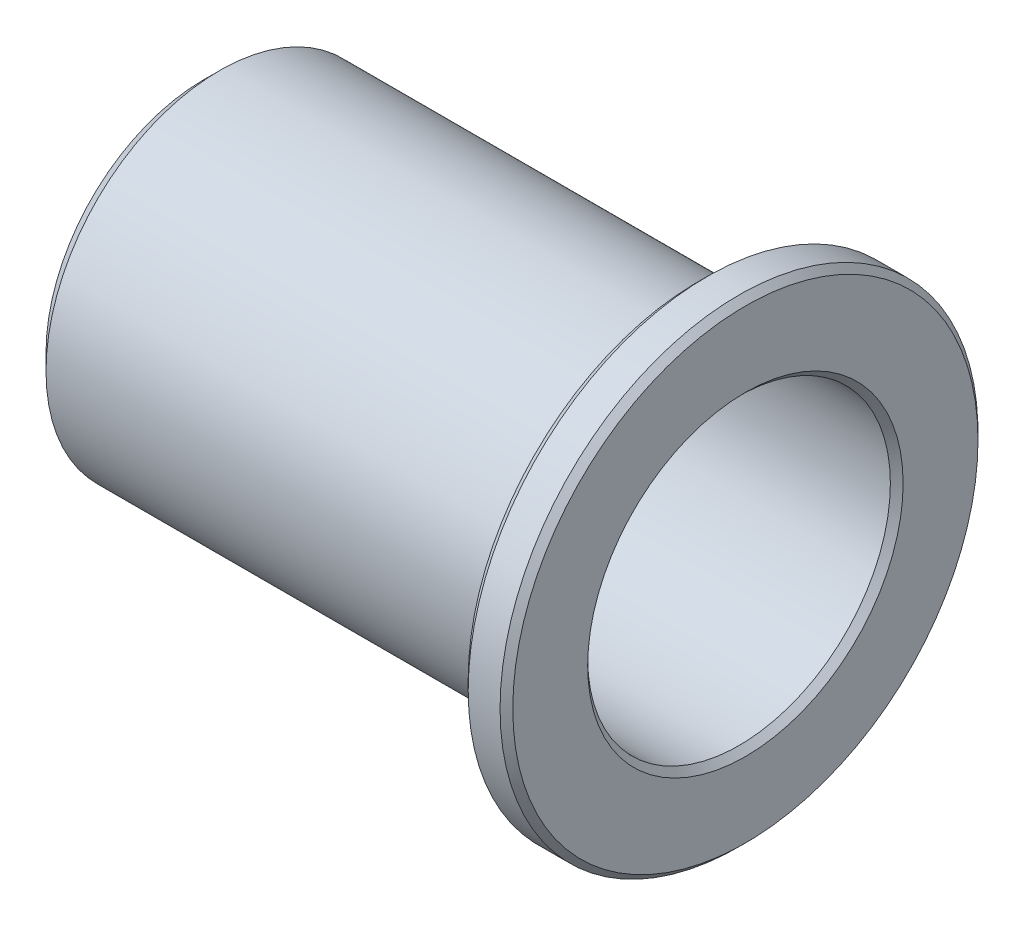
ISO-10303-21;
HEADER;
FILE_DESCRIPTION(('STEP AP214'),'2;1');
FILE_NAME('part.step','',(''),(''),'','','');
FILE_SCHEMA(('AUTOMOTIVE_DESIGN { 1 0 10303 214 1 1 1 1 }'));
ENDSEC;
DATA;
#1=APPLICATION_CONTEXT('core data for automotive mechanical design processes');
#2=APPLICATION_PROTOCOL_DEFINITION('international standard','automotive_design',2000,#1);
#3=PRODUCT_CONTEXT('',#1,'mechanical');
#4=PRODUCT('Part','Part','',(#3));
#5=PRODUCT_RELATED_PRODUCT_CATEGORY('part','',(#4));
#6=PRODUCT_DEFINITION_FORMATION('','',#4);
#7=PRODUCT_DEFINITION_CONTEXT('part definition',#1,'design');
#8=PRODUCT_DEFINITION('design','',#6,#7);
#9=PRODUCT_DEFINITION_SHAPE('','',#8);
#10=(LENGTH_UNIT() NAMED_UNIT(*) SI_UNIT(.MILLI.,.METRE.));
#11=(NAMED_UNIT(*) PLANE_ANGLE_UNIT() SI_UNIT($,.RADIAN.));
#12=(NAMED_UNIT(*) SI_UNIT($,.STERADIAN.) SOLID_ANGLE_UNIT());
#13=UNCERTAINTY_MEASURE_WITH_UNIT(LENGTH_MEASURE(1.E-05),#10,'distance_accuracy_value','');
#14=(GEOMETRIC_REPRESENTATION_CONTEXT(3) GLOBAL_UNCERTAINTY_ASSIGNED_CONTEXT((#13)) GLOBAL_UNIT_ASSIGNED_CONTEXT((#10,
#11,#12)) REPRESENTATION_CONTEXT('',''));
#15=CARTESIAN_POINT('',(0.,0.,0.));
#16=DIRECTION('',(0.,0.,1.));
#17=DIRECTION('',(1.,0.,0.));
#18=AXIS2_PLACEMENT_3D('',#15,#16,#17);
#19=CARTESIAN_POINT('',(-38.4824660542687,0.,0.));
#20=DIRECTION('',(-1.,0.,0.));
#21=DIRECTION('',(0.,0.,1.));
#22=AXIS2_PLACEMENT_3D('',#19,#20,#21);
#23=CYLINDRICAL_SURFACE('',#22,4.75);
#24=CARTESIAN_POINT('',(-14.3486384600237,0.,0.));
#25=DIRECTION('',(-1.,0.,0.));
#26=DIRECTION('',(0.,0.,1.));
#27=AXIS2_PLACEMENT_3D('',#24,#25,#26);
#28=CIRCLE('',#27,4.75);
#29=CARTESIAN_POINT('',(-14.3486384600237,0.,4.75));
#30=VERTEX_POINT('',#29);
#31=EDGE_CURVE('E10',#30,#30,#28,.T.);
#32=ORIENTED_EDGE('',*,*,#31,.F.);
#33=EDGE_LOOP('',(#32));
#34=FACE_BOUND('',#33,.T.);
#35=CARTESIAN_POINT('',(-31.1486384600237,0.,0.));
#36=DIRECTION('',(-1.,0.,0.));
#37=DIRECTION('',(0.,0.,1.));
#38=AXIS2_PLACEMENT_3D('',#35,#36,#37);
#39=CIRCLE('',#38,4.75);
#40=CARTESIAN_POINT('',(-31.1486384600237,0.,4.75));
#41=VERTEX_POINT('',#40);
#42=EDGE_CURVE('E64',#41,#41,#39,.T.);
#43=ORIENTED_EDGE('',*,*,#42,.T.);
#44=EDGE_LOOP('',(#43));
#45=FACE_BOUND('',#44,.T.);
#46=ADVANCED_FACE('F30',(#34,#45),#23,.F.);
#47=CARTESIAN_POINT('',(-14.3486384600237,0.,0.));
#48=DIRECTION('',(1.,0.,0.));
#49=DIRECTION('',(0.,0.,-1.));
#50=AXIS2_PLACEMENT_3D('',#47,#48,#49);
#51=CONICAL_SURFACE('',#50,4.75,0.78539816339745);
#52=CARTESIAN_POINT('',(-14.1486384600237,0.,0.));
#53=DIRECTION('',(-1.,0.,0.));
#54=DIRECTION('',(0.,0.,1.));
#55=AXIS2_PLACEMENT_3D('',#52,#53,#54);
#56=CIRCLE('',#55,4.95);
#57=CARTESIAN_POINT('',(-14.1486384600237,0.,4.95));
#58=VERTEX_POINT('',#57);
#59=EDGE_CURVE('E36',#58,#58,#56,.T.);
#60=ORIENTED_EDGE('',*,*,#59,.F.);
#61=EDGE_LOOP('',(#60));
#62=FACE_BOUND('',#61,.T.);
#63=ORIENTED_EDGE('',*,*,#31,.T.);
#64=EDGE_LOOP('',(#63));
#65=FACE_BOUND('',#64,.T.);
#66=ADVANCED_FACE('F113',(#62,#65),#51,.F.);
#67=CARTESIAN_POINT('',(-14.1486384600237,4.95,0.));
#68=DIRECTION('',(-1.,0.,0.));
#69=DIRECTION('',(0.,0.,1.));
#70=AXIS2_PLACEMENT_3D('',#67,#68,#69);
#71=PLANE('',#70);
#72=CARTESIAN_POINT('',(-14.1486384600237,0.,0.));
#73=DIRECTION('',(-1.,0.,0.));
#74=DIRECTION('',(0.,0.,1.));
#75=AXIS2_PLACEMENT_3D('',#72,#73,#74);
#76=CIRCLE('',#75,7.3);
#77=CARTESIAN_POINT('',(-14.1486384600237,0.,7.3));
#78=VERTEX_POINT('',#77);
#79=EDGE_CURVE('E40',#78,#78,#76,.T.);
#80=ORIENTED_EDGE('',*,*,#79,.F.);
#81=EDGE_LOOP('',(#80));
#82=FACE_BOUND('',#81,.T.);
#83=ORIENTED_EDGE('',*,*,#59,.T.);
#84=EDGE_LOOP('',(#83));
#85=FACE_BOUND('',#84,.T.);
#86=ADVANCED_FACE('F108',(#82,#85),#71,.F.);
#87=CARTESIAN_POINT('',(-14.1486384600237,0.,0.));
#88=DIRECTION('',(-1.,0.,0.));
#89=DIRECTION('',(0.,0.,1.));
#90=AXIS2_PLACEMENT_3D('',#87,#88,#89);
#91=CONICAL_SURFACE('',#90,7.3,0.78539816339745);
#92=CARTESIAN_POINT('',(-14.3486384600237,0.,0.));
#93=DIRECTION('',(-1.,0.,0.));
#94=DIRECTION('',(0.,0.,1.));
#95=AXIS2_PLACEMENT_3D('',#92,#93,#94);
#96=CIRCLE('',#95,7.5);
#97=CARTESIAN_POINT('',(-14.3486384600237,0.,7.5));
#98=VERTEX_POINT('',#97);
#99=EDGE_CURVE('E44',#98,#98,#96,.T.);
#100=ORIENTED_EDGE('',*,*,#99,.F.);
#101=EDGE_LOOP('',(#100));
#102=FACE_BOUND('',#101,.T.);
#103=ORIENTED_EDGE('',*,*,#79,.T.);
#104=EDGE_LOOP('',(#103));
#105=FACE_BOUND('',#104,.T.);
#106=ADVANCED_FACE('F102',(#102,#105),#91,.T.);
#107=CARTESIAN_POINT('',(-38.4824660542687,0.,0.));
#108=DIRECTION('',(-1.,0.,0.));
#109=DIRECTION('',(0.,0.,1.));
#110=AXIS2_PLACEMENT_3D('',#107,#108,#109);
#111=CYLINDRICAL_SURFACE('',#110,7.5);
#112=CARTESIAN_POINT('',(-15.3486384600237,0.,0.));
#113=DIRECTION('',(-1.,0.,0.));
#114=DIRECTION('',(0.,0.,1.));
#115=AXIS2_PLACEMENT_3D('',#112,#113,#114);
#116=CIRCLE('',#115,7.5);
#117=CARTESIAN_POINT('',(-15.3486384600237,0.,7.5));
#118=VERTEX_POINT('',#117);
#119=EDGE_CURVE('E49',#118,#118,#116,.T.);
#120=ORIENTED_EDGE('',*,*,#119,.F.);
#121=EDGE_LOOP('',(#120));
#122=FACE_BOUND('',#121,.T.);
#123=ORIENTED_EDGE('',*,*,#99,.T.);
#124=EDGE_LOOP('',(#123));
#125=FACE_BOUND('',#124,.T.);
#126=ADVANCED_FACE('F96',(#122,#125),#111,.T.);
#127=CARTESIAN_POINT('',(-15.3486384600237,0.,0.));
#128=DIRECTION('',(1.,0.,0.));
#129=DIRECTION('',(0.,0.,-1.));
#130=AXIS2_PLACEMENT_3D('',#127,#128,#129);
#131=CONICAL_SURFACE('',#130,7.5,0.785398163397445);
#132=CARTESIAN_POINT('',(-15.6486384600237,0.,0.));
#133=DIRECTION('',(-1.,0.,0.));
#134=DIRECTION('',(0.,0.,1.));
#135=AXIS2_PLACEMENT_3D('',#132,#133,#134);
#136=CIRCLE('',#135,7.2);
#137=CARTESIAN_POINT('',(-15.6486384600237,0.,7.2));
#138=VERTEX_POINT('',#137);
#139=EDGE_CURVE('E52',#138,#138,#136,.T.);
#140=ORIENTED_EDGE('',*,*,#139,.F.);
#141=EDGE_LOOP('',(#140));
#142=FACE_BOUND('',#141,.T.);
#143=ORIENTED_EDGE('',*,*,#119,.T.);
#144=EDGE_LOOP('',(#143));
#145=FACE_BOUND('',#144,.T.);
#146=ADVANCED_FACE('F90',(#142,#145),#131,.T.);
#147=CARTESIAN_POINT('',(-15.6486384600237,5.45,0.));
#148=DIRECTION('',(1.,0.,0.));
#149=DIRECTION('',(0.,0.,-1.));
#150=AXIS2_PLACEMENT_3D('',#147,#148,#149);
#151=PLANE('',#150);
#152=CARTESIAN_POINT('',(-15.6486384600237,0.,0.));
#153=DIRECTION('',(-1.,0.,0.));
#154=DIRECTION('',(0.,0.,1.));
#155=AXIS2_PLACEMENT_3D('',#152,#153,#154);
#156=CIRCLE('',#155,5.45);
#157=CARTESIAN_POINT('',(-15.6486384600237,0.,5.45));
#158=VERTEX_POINT('',#157);
#159=EDGE_CURVE('E55',#158,#158,#156,.T.);
#160=ORIENTED_EDGE('',*,*,#159,.F.);
#161=EDGE_LOOP('',(#160));
#162=FACE_BOUND('',#161,.T.);
#163=ORIENTED_EDGE('',*,*,#139,.T.);
#164=EDGE_LOOP('',(#163));
#165=FACE_BOUND('',#164,.T.);
#166=ADVANCED_FACE('F84',(#162,#165),#151,.F.);
#167=CARTESIAN_POINT('',(-38.4824660542687,0.,0.));
#168=DIRECTION('',(-1.,0.,0.));
#169=DIRECTION('',(0.,0.,1.));
#170=AXIS2_PLACEMENT_3D('',#167,#168,#169);
#171=CYLINDRICAL_SURFACE('',#170,5.45);
#172=CARTESIAN_POINT('',(-30.6486384600237,0.,0.));
#173=DIRECTION('',(-1.,0.,0.));
#174=DIRECTION('',(0.,0.,1.));
#175=AXIS2_PLACEMENT_3D('',#172,#173,#174);
#176=CIRCLE('',#175,5.45);
#177=CARTESIAN_POINT('',(-30.6486384600237,0.,5.45));
#178=VERTEX_POINT('',#177);
#179=EDGE_CURVE('E58',#178,#178,#176,.T.);
#180=ORIENTED_EDGE('',*,*,#179,.F.);
#181=EDGE_LOOP('',(#180));
#182=FACE_BOUND('',#181,.T.);
#183=ORIENTED_EDGE('',*,*,#159,.T.);
#184=EDGE_LOOP('',(#183));
#185=FACE_BOUND('',#184,.T.);
#186=ADVANCED_FACE('F78',(#182,#185),#171,.T.);
#187=CARTESIAN_POINT('',(-30.6486384600237,0.,0.));
#188=DIRECTION('',(1.,0.,0.));
#189=DIRECTION('',(0.,0.,-1.));
#190=AXIS2_PLACEMENT_3D('',#187,#188,#189);
#191=CONICAL_SURFACE('',#190,5.45,0.785398163397448);
#192=CARTESIAN_POINT('',(-31.1486384600237,0.,0.));
#193=DIRECTION('',(-1.,0.,0.));
#194=DIRECTION('',(0.,0.,1.));
#195=AXIS2_PLACEMENT_3D('',#192,#193,#194);
#196=CIRCLE('',#195,4.95);
#197=CARTESIAN_POINT('',(-31.1486384600237,0.,4.95));
#198=VERTEX_POINT('',#197);
#199=EDGE_CURVE('E61',#198,#198,#196,.T.);
#200=ORIENTED_EDGE('',*,*,#199,.F.);
#201=EDGE_LOOP('',(#200));
#202=FACE_BOUND('',#201,.T.);
#203=ORIENTED_EDGE('',*,*,#179,.T.);
#204=EDGE_LOOP('',(#203));
#205=FACE_BOUND('',#204,.T.);
#206=ADVANCED_FACE('F72',(#202,#205),#191,.T.);
#207=CARTESIAN_POINT('',(-31.1486384600237,4.75,0.));
#208=DIRECTION('',(1.,0.,0.));
#209=DIRECTION('',(0.,0.,-1.));
#210=AXIS2_PLACEMENT_3D('',#207,#208,#209);
#211=PLANE('',#210);
#212=ORIENTED_EDGE('',*,*,#42,.F.);
#213=EDGE_LOOP('',(#212));
#214=FACE_BOUND('',#213,.T.);
#215=ORIENTED_EDGE('',*,*,#199,.T.);
#216=EDGE_LOOP('',(#215));
#217=FACE_BOUND('',#216,.T.);
#218=ADVANCED_FACE('F69',(#214,#217),#211,.F.);
#219=CLOSED_SHELL('',(#46,#66,#86,#106,#126,#146,#166,#186,#206,#218));
#220=MANIFOLD_SOLID_BREP('B2',#219);
#221=ADVANCED_BREP_SHAPE_REPRESENTATION('',(#18,#220),#14);
#222=SHAPE_DEFINITION_REPRESENTATION(#9,#221);
ENDSEC;
END-ISO-10303-21;
